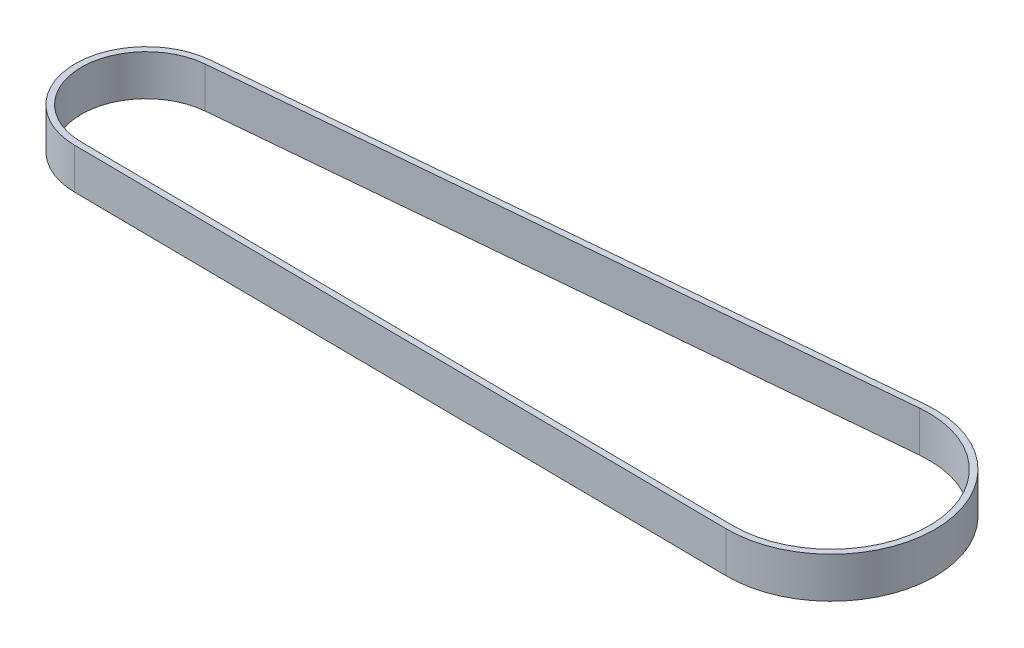
ISO-10303-21;
HEADER;
FILE_DESCRIPTION(('STEP AP214'),'2;1');
FILE_NAME('part.step','',(''),(''),'','','');
FILE_SCHEMA(('AUTOMOTIVE_DESIGN { 1 0 10303 214 1 1 1 1 }'));
ENDSEC;
DATA;
#1=APPLICATION_CONTEXT('core data for automotive mechanical design processes');
#2=APPLICATION_PROTOCOL_DEFINITION('international standard','automotive_design',2000,#1);
#3=PRODUCT_CONTEXT('',#1,'mechanical');
#4=PRODUCT('Part','Part','',(#3));
#5=PRODUCT_RELATED_PRODUCT_CATEGORY('part','',(#4));
#6=PRODUCT_DEFINITION_FORMATION('','',#4);
#7=PRODUCT_DEFINITION_CONTEXT('part definition',#1,'design');
#8=PRODUCT_DEFINITION('design','',#6,#7);
#9=PRODUCT_DEFINITION_SHAPE('','',#8);
#10=(LENGTH_UNIT() NAMED_UNIT(*) SI_UNIT(.MILLI.,.METRE.));
#11=(NAMED_UNIT(*) PLANE_ANGLE_UNIT() SI_UNIT($,.RADIAN.));
#12=(NAMED_UNIT(*) SI_UNIT($,.STERADIAN.) SOLID_ANGLE_UNIT());
#13=UNCERTAINTY_MEASURE_WITH_UNIT(LENGTH_MEASURE(1.E-05),#10,'distance_accuracy_value','');
#14=(GEOMETRIC_REPRESENTATION_CONTEXT(3) GLOBAL_UNCERTAINTY_ASSIGNED_CONTEXT((#13)) GLOBAL_UNIT_ASSIGNED_CONTEXT((#10,
#11,#12)) REPRESENTATION_CONTEXT('',''));
#15=CARTESIAN_POINT('',(0.,0.,0.));
#16=DIRECTION('',(0.,0.,1.));
#17=DIRECTION('',(1.,0.,0.));
#18=AXIS2_PLACEMENT_3D('',#15,#16,#17);
#19=CARTESIAN_POINT('',(-71.3206696131011,10.,6.49634918662514));
#20=DIRECTION('',(0.,1.,0.));
#21=DIRECTION('',(0.,0.,1.));
#22=AXIS2_PLACEMENT_3D('',#19,#20,#21);
#23=PLANE('',#22);
#24=CARTESIAN_POINT('',(-71.3206696131011,10.,6.49634918662514));
#25=DIRECTION('',(0.,1.,0.));
#26=DIRECTION('',(0.,0.,1.));
#27=AXIS2_PLACEMENT_3D('',#24,#25,#26);
#28=CIRCLE('',#27,17.415);
#29=CARTESIAN_POINT('',(-72.8892818585099,10.,-10.8478625459257));
#30=VERTEX_POINT('',#29);
#31=CARTESIAN_POINT('',(-71.4919152034312,10.,23.910507218175));
#32=VERTEX_POINT('',#31);
#33=EDGE_CURVE('E153',#30,#32,#28,.T.);
#34=ORIENTED_EDGE('',*,*,#33,.T.);
#35=DIRECTION('',(0.99995165268733,0.,0.00983322367672132));
#36=VECTOR('',#35,1.);
#37=CARTESIAN_POINT('',(-71.4919152034312,10.,23.910507218175));
#38=LINE('',#37,#36);
#39=CARTESIAN_POINT('',(90.0200354514192,10.,25.4987671435269));
#40=VERTEX_POINT('',#39);
#41=EDGE_CURVE('E157',#32,#40,#38,.T.);
#42=ORIENTED_EDGE('',*,*,#41,.T.);
#43=CARTESIAN_POINT('',(90.2707826551756,10.,0.));
#44=DIRECTION('',(0.,1.,0.));
#45=DIRECTION('',(0.,0.,1.));
#46=AXIS2_PLACEMENT_3D('',#43,#44,#45);
#47=CIRCLE('',#46,25.5);
#48=CARTESIAN_POINT('',(87.9739344060844,10.,-25.3963479287997));
#49=VERTEX_POINT('',#48);
#50=EDGE_CURVE('E161',#40,#49,#47,.T.);
#51=ORIENTED_EDGE('',*,*,#50,.T.);
#52=DIRECTION('',(-0.995935212894104,0.,0.0900724803565205));
#53=VECTOR('',#52,1.);
#54=CARTESIAN_POINT('',(-72.8892818585099,10.,-10.8478625459257));
#55=LINE('',#54,#53);
#56=EDGE_CURVE('E164',#49,#30,#55,.T.);
#57=ORIENTED_EDGE('',*,*,#56,.T.);
#58=EDGE_LOOP('',(#34,#42,#51,#57));
#59=FACE_BOUND('',#58,.T.);
#60=DIRECTION('',(0.99995165268733,0.,0.00983322367672123));
#61=VECTOR('',#60,1.);
#62=CARTESIAN_POINT('',(-71.4771653679161,10.,22.410579739144));
#63=LINE('',#62,#61);
#64=CARTESIAN_POINT('',(-71.4771653679161,10.,22.410579739144));
#65=VERTEX_POINT('',#64);
#66=CARTESIAN_POINT('',(90.0347852869343,10.,23.9988396644959));
#67=VERTEX_POINT('',#66);
#68=EDGE_CURVE('E114',#65,#67,#63,.T.);
#69=ORIENTED_EDGE('',*,*,#68,.F.);
#70=CARTESIAN_POINT('',(-71.3206696131011,10.,6.49634918662514));
#71=DIRECTION('',(0.,1.,0.));
#72=DIRECTION('',(0.,0.,1.));
#73=AXIS2_PLACEMENT_3D('',#70,#71,#72);
#74=CIRCLE('',#73,15.915);
#75=CARTESIAN_POINT('',(-72.7541731379752,10.,-9.35395972658451));
#76=VERTEX_POINT('',#75);
#77=EDGE_CURVE('E105',#76,#65,#74,.T.);
#78=ORIENTED_EDGE('',*,*,#77,.F.);
#79=DIRECTION('',(-0.995935212894104,0.,0.0900724803565205));
#80=VECTOR('',#79,1.);
#81=CARTESIAN_POINT('',(-72.7541731379752,10.,-9.35395972658451));
#82=LINE('',#81,#80);
#83=CARTESIAN_POINT('',(88.1090431266191,10.,-23.9024451094585));
#84=VERTEX_POINT('',#83);
#85=EDGE_CURVE('E131',#84,#76,#82,.T.);
#86=ORIENTED_EDGE('',*,*,#85,.F.);
#87=CARTESIAN_POINT('',(90.2707826551756,10.,0.));
#88=DIRECTION('',(0.,1.,0.));
#89=DIRECTION('',(0.,0.,1.));
#90=AXIS2_PLACEMENT_3D('',#87,#88,#89);
#91=CIRCLE('',#90,24.);
#92=EDGE_CURVE('E127',#67,#84,#91,.T.);
#93=ORIENTED_EDGE('',*,*,#92,.F.);
#94=EDGE_LOOP('',(#69,#78,#86,#93));
#95=FACE_BOUND('',#94,.T.);
#96=ADVANCED_FACE('F39',(#59,#95),#23,.T.);
#97=CARTESIAN_POINT('',(-71.3206696131011,0.,6.49634918662514));
#98=DIRECTION('',(0.,1.,0.));
#99=DIRECTION('',(0.,0.,1.));
#100=AXIS2_PLACEMENT_3D('',#97,#98,#99);
#101=PLANE('',#100);
#102=CARTESIAN_POINT('',(-71.3206696131011,0.,6.49634918662514));
#103=DIRECTION('',(0.,1.,0.));
#104=DIRECTION('',(0.,0.,1.));
#105=AXIS2_PLACEMENT_3D('',#102,#103,#104);
#106=CIRCLE('',#105,17.415);
#107=CARTESIAN_POINT('',(-72.8892818585099,0.,-10.8478625459257));
#108=VERTEX_POINT('',#107);
#109=CARTESIAN_POINT('',(-71.4919152034312,0.,23.910507218175));
#110=VERTEX_POINT('',#109);
#111=EDGE_CURVE('E123',#108,#110,#106,.T.);
#112=ORIENTED_EDGE('',*,*,#111,.F.);
#113=DIRECTION('',(-0.995935212894104,0.,0.0900724803565205));
#114=VECTOR('',#113,1.);
#115=CARTESIAN_POINT('',(-72.8892818585099,0.,-10.8478625459257));
#116=LINE('',#115,#114);
#117=CARTESIAN_POINT('',(87.9739344060844,0.,-25.3963479287997));
#118=VERTEX_POINT('',#117);
#119=EDGE_CURVE('E158',#118,#108,#116,.T.);
#120=ORIENTED_EDGE('',*,*,#119,.F.);
#121=CARTESIAN_POINT('',(90.2707826551756,0.,0.));
#122=DIRECTION('',(0.,1.,0.));
#123=DIRECTION('',(0.,0.,1.));
#124=AXIS2_PLACEMENT_3D('',#121,#122,#123);
#125=CIRCLE('',#124,25.5);
#126=CARTESIAN_POINT('',(90.0200354514192,0.,25.4987671435269));
#127=VERTEX_POINT('',#126);
#128=EDGE_CURVE('E174',#127,#118,#125,.T.);
#129=ORIENTED_EDGE('',*,*,#128,.F.);
#130=DIRECTION('',(0.99995165268733,0.,0.00983322367672132));
#131=VECTOR('',#130,1.);
#132=CARTESIAN_POINT('',(-71.4919152034312,0.,23.910507218175));
#133=LINE('',#132,#131);
#134=EDGE_CURVE('E171',#110,#127,#133,.T.);
#135=ORIENTED_EDGE('',*,*,#134,.F.);
#136=EDGE_LOOP('',(#112,#120,#129,#135));
#137=FACE_BOUND('',#136,.T.);
#138=CARTESIAN_POINT('',(-71.3206696131011,0.,6.49634918662514));
#139=DIRECTION('',(0.,1.,0.));
#140=DIRECTION('',(0.,0.,1.));
#141=AXIS2_PLACEMENT_3D('',#138,#139,#140);
#142=CIRCLE('',#141,15.915);
#143=CARTESIAN_POINT('',(-72.7541731379752,0.,-9.35395972658451));
#144=VERTEX_POINT('',#143);
#145=CARTESIAN_POINT('',(-71.4771653679161,0.,22.410579739144));
#146=VERTEX_POINT('',#145);
#147=EDGE_CURVE('E63',#144,#146,#142,.T.);
#148=ORIENTED_EDGE('',*,*,#147,.T.);
#149=DIRECTION('',(0.99995165268733,0.,0.00983322367672123));
#150=VECTOR('',#149,1.);
#151=CARTESIAN_POINT('',(-71.4771653679161,0.,22.410579739144));
#152=LINE('',#151,#150);
#153=CARTESIAN_POINT('',(90.0347852869343,0.,23.9988396644959));
#154=VERTEX_POINT('',#153);
#155=EDGE_CURVE('E121',#146,#154,#152,.T.);
#156=ORIENTED_EDGE('',*,*,#155,.T.);
#157=CARTESIAN_POINT('',(90.2707826551756,0.,0.));
#158=DIRECTION('',(0.,1.,0.));
#159=DIRECTION('',(0.,0.,1.));
#160=AXIS2_PLACEMENT_3D('',#157,#158,#159);
#161=CIRCLE('',#160,24.);
#162=CARTESIAN_POINT('',(88.1090431266191,0.,-23.9024451094585));
#163=VERTEX_POINT('',#162);
#164=EDGE_CURVE('E140',#154,#163,#161,.T.);
#165=ORIENTED_EDGE('',*,*,#164,.T.);
#166=DIRECTION('',(-0.995935212894104,0.,0.0900724803565205));
#167=VECTOR('',#166,1.);
#168=CARTESIAN_POINT('',(-72.7541731379752,0.,-9.35395972658451));
#169=LINE('',#168,#167);
#170=EDGE_CURVE('E115',#163,#144,#169,.T.);
#171=ORIENTED_EDGE('',*,*,#170,.T.);
#172=EDGE_LOOP('',(#148,#156,#165,#171));
#173=FACE_BOUND('',#172,.T.);
#174=ADVANCED_FACE('F197',(#137,#173),#101,.F.);
#175=CARTESIAN_POINT('',(-71.3206696131011,10.,6.49634918662514));
#176=DIRECTION('',(0.,-1.,0.));
#177=DIRECTION('',(0.,0.,-1.));
#178=AXIS2_PLACEMENT_3D('',#175,#176,#177);
#179=CYLINDRICAL_SURFACE('',#178,17.415);
#180=ORIENTED_EDGE('',*,*,#111,.T.);
#181=DIRECTION('',(0.,-1.,0.));
#182=VECTOR('',#181,1.);
#183=CARTESIAN_POINT('',(-71.4919152034312,10.,23.910507218175));
#184=LINE('',#183,#182);
#185=EDGE_CURVE('E11',#32,#110,#184,.T.);
#186=ORIENTED_EDGE('',*,*,#185,.F.);
#187=ORIENTED_EDGE('',*,*,#33,.F.);
#188=DIRECTION('',(0.,-1.,0.));
#189=VECTOR('',#188,1.);
#190=CARTESIAN_POINT('',(-72.8892818585099,10.,-10.8478625459257));
#191=LINE('',#190,#189);
#192=EDGE_CURVE('E167',#30,#108,#191,.T.);
#193=ORIENTED_EDGE('',*,*,#192,.T.);
#194=EDGE_LOOP('',(#180,#186,#187,#193));
#195=FACE_BOUND('',#194,.T.);
#196=ADVANCED_FACE('F41',(#195),#179,.T.);
#197=CARTESIAN_POINT('',(-71.4919152034312,10.,23.910507218175));
#198=DIRECTION('',(0.00983322367672132,0.,-0.999951652687331));
#199=DIRECTION('',(-0.999951652687331,0.,-0.00983322367672132));
#200=AXIS2_PLACEMENT_3D('',#197,#198,#199);
#201=PLANE('',#200);
#202=ORIENTED_EDGE('',*,*,#134,.T.);
#203=DIRECTION('',(0.,-1.,0.));
#204=VECTOR('',#203,1.);
#205=CARTESIAN_POINT('',(90.0200354514192,10.,25.4987671435269));
#206=LINE('',#205,#204);
#207=EDGE_CURVE('E48',#40,#127,#206,.T.);
#208=ORIENTED_EDGE('',*,*,#207,.F.);
#209=ORIENTED_EDGE('',*,*,#41,.F.);
#210=ORIENTED_EDGE('',*,*,#185,.T.);
#211=EDGE_LOOP('',(#202,#208,#209,#210));
#212=FACE_BOUND('',#211,.T.);
#213=ADVANCED_FACE('F207',(#212),#201,.F.);
#214=CARTESIAN_POINT('',(90.2707826551756,10.,0.));
#215=DIRECTION('',(0.,-1.,0.));
#216=DIRECTION('',(0.,0.,-1.));
#217=AXIS2_PLACEMENT_3D('',#214,#215,#216);
#218=CYLINDRICAL_SURFACE('',#217,25.5);
#219=ORIENTED_EDGE('',*,*,#128,.T.);
#220=DIRECTION('',(0.,-1.,0.));
#221=VECTOR('',#220,1.);
#222=CARTESIAN_POINT('',(87.9739344060844,10.,-25.3963479287997));
#223=LINE('',#222,#221);
#224=EDGE_CURVE('E182',#49,#118,#223,.T.);
#225=ORIENTED_EDGE('',*,*,#224,.F.);
#226=ORIENTED_EDGE('',*,*,#50,.F.);
#227=ORIENTED_EDGE('',*,*,#207,.T.);
#228=EDGE_LOOP('',(#219,#225,#226,#227));
#229=FACE_BOUND('',#228,.T.);
#230=ADVANCED_FACE('F191',(#229),#218,.T.);
#231=CARTESIAN_POINT('',(-72.8892818585099,10.,-10.8478625459257));
#232=DIRECTION('',(0.0900724803565205,0.,0.995935212894104));
#233=DIRECTION('',(0.995935212894104,0.,-0.0900724803565205));
#234=AXIS2_PLACEMENT_3D('',#231,#232,#233);
#235=PLANE('',#234);
#236=ORIENTED_EDGE('',*,*,#119,.T.);
#237=ORIENTED_EDGE('',*,*,#192,.F.);
#238=ORIENTED_EDGE('',*,*,#56,.F.);
#239=ORIENTED_EDGE('',*,*,#224,.T.);
#240=EDGE_LOOP('',(#236,#237,#238,#239));
#241=FACE_BOUND('',#240,.T.);
#242=ADVANCED_FACE('F201',(#241),#235,.F.);
#243=CARTESIAN_POINT('',(-71.3206696131011,10.,6.49634918662514));
#244=DIRECTION('',(0.,-1.,0.));
#245=DIRECTION('',(0.,0.,-1.));
#246=AXIS2_PLACEMENT_3D('',#243,#244,#245);
#247=CYLINDRICAL_SURFACE('',#246,15.915);
#248=ORIENTED_EDGE('',*,*,#147,.F.);
#249=DIRECTION('',(0.,-1.,0.));
#250=VECTOR('',#249,1.);
#251=CARTESIAN_POINT('',(-72.7541731379752,10.,-9.35395972658451));
#252=LINE('',#251,#250);
#253=EDGE_CURVE('E109',#76,#144,#252,.T.);
#254=ORIENTED_EDGE('',*,*,#253,.F.);
#255=ORIENTED_EDGE('',*,*,#77,.T.);
#256=DIRECTION('',(0.,-1.,0.));
#257=VECTOR('',#256,1.);
#258=CARTESIAN_POINT('',(-71.4771653679161,10.,22.410579739144));
#259=LINE('',#258,#257);
#260=EDGE_CURVE('E108',#65,#146,#259,.T.);
#261=ORIENTED_EDGE('',*,*,#260,.T.);
#262=EDGE_LOOP('',(#248,#254,#255,#261));
#263=FACE_BOUND('',#262,.T.);
#264=ADVANCED_FACE('F107',(#263),#247,.F.);
#265=CARTESIAN_POINT('',(-71.4771653679161,10.,22.410579739144));
#266=DIRECTION('',(0.00983322367672123,0.,-0.999951652687331));
#267=DIRECTION('',(-0.999951652687331,0.,-0.00983322367672123));
#268=AXIS2_PLACEMENT_3D('',#265,#266,#267);
#269=PLANE('',#268);
#270=ORIENTED_EDGE('',*,*,#155,.F.);
#271=ORIENTED_EDGE('',*,*,#260,.F.);
#272=ORIENTED_EDGE('',*,*,#68,.T.);
#273=DIRECTION('',(0.,-1.,0.));
#274=VECTOR('',#273,1.);
#275=CARTESIAN_POINT('',(90.0347852869343,10.,23.9988396644959));
#276=LINE('',#275,#274);
#277=EDGE_CURVE('E124',#67,#154,#276,.T.);
#278=ORIENTED_EDGE('',*,*,#277,.T.);
#279=EDGE_LOOP('',(#270,#271,#272,#278));
#280=FACE_BOUND('',#279,.T.);
#281=ADVANCED_FACE('F118',(#280),#269,.T.);
#282=CARTESIAN_POINT('',(90.2707826551756,10.,0.));
#283=DIRECTION('',(0.,-1.,0.));
#284=DIRECTION('',(0.,0.,-1.));
#285=AXIS2_PLACEMENT_3D('',#282,#283,#284);
#286=CYLINDRICAL_SURFACE('',#285,24.);
#287=ORIENTED_EDGE('',*,*,#164,.F.);
#288=ORIENTED_EDGE('',*,*,#277,.F.);
#289=ORIENTED_EDGE('',*,*,#92,.T.);
#290=DIRECTION('',(0.,-1.,0.));
#291=VECTOR('',#290,1.);
#292=CARTESIAN_POINT('',(88.1090431266191,10.,-23.9024451094585));
#293=LINE('',#292,#291);
#294=EDGE_CURVE('E55',#84,#163,#293,.T.);
#295=ORIENTED_EDGE('',*,*,#294,.T.);
#296=EDGE_LOOP('',(#287,#288,#289,#295));
#297=FACE_BOUND('',#296,.T.);
#298=ADVANCED_FACE('F230',(#297),#286,.F.);
#299=CARTESIAN_POINT('',(-72.7541731379752,10.,-9.35395972658451));
#300=DIRECTION('',(0.0900724803565205,0.,0.995935212894104));
#301=DIRECTION('',(0.995935212894104,0.,-0.0900724803565205));
#302=AXIS2_PLACEMENT_3D('',#299,#300,#301);
#303=PLANE('',#302);
#304=ORIENTED_EDGE('',*,*,#170,.F.);
#305=ORIENTED_EDGE('',*,*,#294,.F.);
#306=ORIENTED_EDGE('',*,*,#85,.T.);
#307=ORIENTED_EDGE('',*,*,#253,.T.);
#308=EDGE_LOOP('',(#304,#305,#306,#307));
#309=FACE_BOUND('',#308,.T.);
#310=ADVANCED_FACE('F234',(#309),#303,.T.);
#311=CLOSED_SHELL('',(#96,#174,#196,#213,#230,#242,#264,#281,#298,#310));
#312=MANIFOLD_SOLID_BREP('B2',#311);
#313=ADVANCED_BREP_SHAPE_REPRESENTATION('',(#18,#312),#14);
#314=SHAPE_DEFINITION_REPRESENTATION(#9,#313);
ENDSEC;
END-ISO-10303-21;
